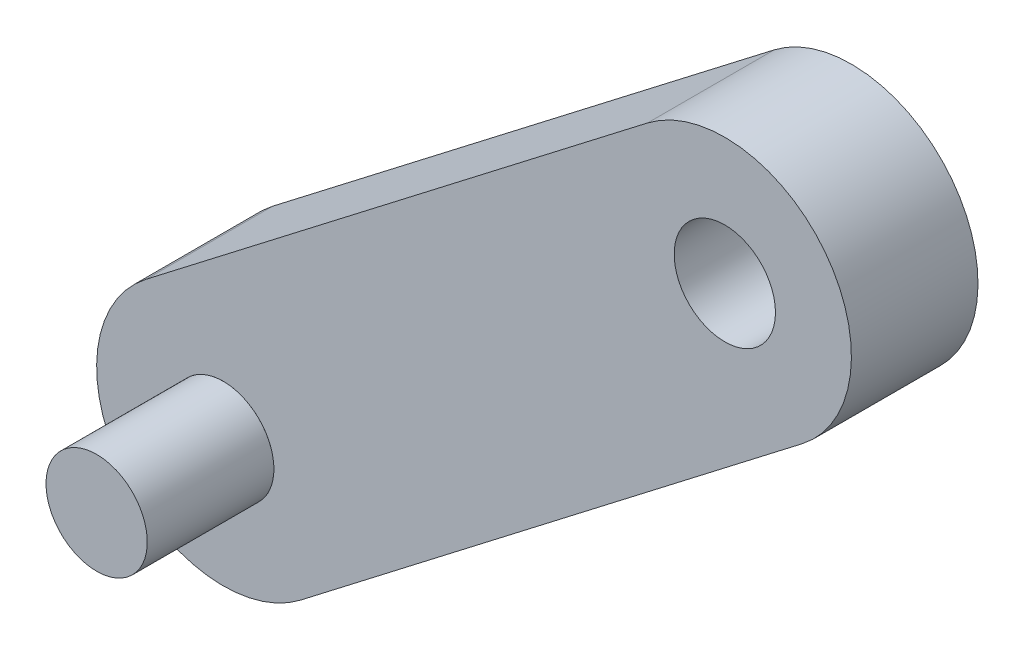
ISO-10303-21;
HEADER;
FILE_DESCRIPTION(('STEP AP214'),'2;1');
FILE_NAME('part.step','',(''),(''),'','','');
FILE_SCHEMA(('AUTOMOTIVE_DESIGN { 1 0 10303 214 1 1 1 1 }'));
ENDSEC;
DATA;
#1=APPLICATION_CONTEXT('core data for automotive mechanical design processes');
#2=APPLICATION_PROTOCOL_DEFINITION('international standard','automotive_design',2000,#1);
#3=PRODUCT_CONTEXT('',#1,'mechanical');
#4=PRODUCT('Part','Part','',(#3));
#5=PRODUCT_RELATED_PRODUCT_CATEGORY('part','',(#4));
#6=PRODUCT_DEFINITION_FORMATION('','',#4);
#7=PRODUCT_DEFINITION_CONTEXT('part definition',#1,'design');
#8=PRODUCT_DEFINITION('design','',#6,#7);
#9=PRODUCT_DEFINITION_SHAPE('','',#8);
#10=(LENGTH_UNIT() NAMED_UNIT(*) SI_UNIT(.MILLI.,.METRE.));
#11=(NAMED_UNIT(*) PLANE_ANGLE_UNIT() SI_UNIT($,.RADIAN.));
#12=(NAMED_UNIT(*) SI_UNIT($,.STERADIAN.) SOLID_ANGLE_UNIT());
#13=UNCERTAINTY_MEASURE_WITH_UNIT(LENGTH_MEASURE(1.E-05),#10,'distance_accuracy_value','');
#14=(GEOMETRIC_REPRESENTATION_CONTEXT(3) GLOBAL_UNCERTAINTY_ASSIGNED_CONTEXT((#13)) GLOBAL_UNIT_ASSIGNED_CONTEXT((#10,
#11,#12)) REPRESENTATION_CONTEXT('',''));
#15=CARTESIAN_POINT('',(0.,0.,0.));
#16=DIRECTION('',(0.,0.,1.));
#17=DIRECTION('',(1.,0.,0.));
#18=AXIS2_PLACEMENT_3D('',#15,#16,#17);
#19=CARTESIAN_POINT('',(-44.3801418640162,84.6953489238267,5.));
#20=DIRECTION('',(0.,0.,-1.));
#21=DIRECTION('',(1.,0.,0.));
#22=AXIS2_PLACEMENT_3D('',#19,#20,#21);
#23=CYLINDRICAL_SURFACE('',#22,2.);
#24=CARTESIAN_POINT('',(-44.3801418640162,84.6953489238267,5.));
#25=DIRECTION('',(0.,0.,-1.));
#26=DIRECTION('',(-1.,0.,0.));
#27=AXIS2_PLACEMENT_3D('',#24,#25,#26);
#28=CIRCLE('',#27,2.);
#29=CARTESIAN_POINT('',(-46.3801418640162,84.6953489238267,5.));
#30=VERTEX_POINT('',#29);
#31=EDGE_CURVE('E11',#30,#30,#28,.T.);
#32=ORIENTED_EDGE('',*,*,#31,.T.);
#33=EDGE_LOOP('',(#32));
#34=FACE_BOUND('',#33,.T.);
#35=CARTESIAN_POINT('',(-44.3801418640162,84.6953489238267,0.));
#36=DIRECTION('',(0.,0.,-1.));
#37=DIRECTION('',(-1.,0.,0.));
#38=AXIS2_PLACEMENT_3D('',#35,#36,#37);
#39=CIRCLE('',#38,2.);
#40=CARTESIAN_POINT('',(-46.3801418640162,84.6953489238267,0.));
#41=VERTEX_POINT('',#40);
#42=EDGE_CURVE('E48',#41,#41,#39,.T.);
#43=ORIENTED_EDGE('',*,*,#42,.F.);
#44=EDGE_LOOP('',(#43));
#45=FACE_BOUND('',#44,.T.);
#46=ADVANCED_FACE('F45',(#34,#45),#23,.T.);
#47=CARTESIAN_POINT('',(-44.3801418640162,84.6953489238267,5.));
#48=DIRECTION('',(0.,0.,1.));
#49=DIRECTION('',(-1.,0.,0.));
#50=AXIS2_PLACEMENT_3D('',#47,#48,#49);
#51=PLANE('',#50);
#52=ORIENTED_EDGE('',*,*,#31,.F.);
#53=EDGE_LOOP('',(#52));
#54=FACE_BOUND('',#53,.T.);
#55=ADVANCED_FACE('F60',(#54),#51,.T.);
#56=CARTESIAN_POINT('',(-44.3801418640162,84.6953489238267,0.));
#57=DIRECTION('',(0.,0.,1.));
#58=DIRECTION('',(-1.,0.,0.));
#59=AXIS2_PLACEMENT_3D('',#56,#57,#58);
#60=PLANE('',#59);
#61=ORIENTED_EDGE('',*,*,#42,.T.);
#62=EDGE_LOOP('',(#61));
#63=FACE_BOUND('',#62,.T.);
#64=ADVANCED_FACE('F57',(#63),#60,.F.);
#65=CLOSED_SHELL('',(#46,#55,#64));
#66=MANIFOLD_SOLID_BREP('B2',#65);
#67=CARTESIAN_POINT('',(-54.4085511361733,70.6633839518424,-5.));
#68=DIRECTION('',(-0.610077729525656,0.792341570244058,0.));
#69=DIRECTION('',(-0.792341570244058,-0.610077729525656,0.));
#70=AXIS2_PLACEMENT_3D('',#67,#68,#69);
#71=PLANE('',#70);
#72=DIRECTION('',(0.792341570244058,0.610077729525656,0.));
#73=VECTOR('',#72,1.);
#74=CARTESIAN_POINT('',(-54.4085511361733,70.6633839518424,0.));
#75=LINE('',#74,#73);
#76=CARTESIAN_POINT('',(-41.3297532163879,80.7336410726064,0.));
#77=VERTEX_POINT('',#76);
#78=CARTESIAN_POINT('',(-21.5212139602865,95.9855843107478,0.));
#79=VERTEX_POINT('',#78);
#80=EDGE_CURVE('E158',#77,#79,#75,.T.);
#81=ORIENTED_EDGE('',*,*,#80,.F.);
#82=DIRECTION('',(0.,0.,1.));
#83=VECTOR('',#82,1.);
#84=CARTESIAN_POINT('',(-41.3297532163879,80.7336410726064,-5.));
#85=LINE('',#84,#83);
#86=CARTESIAN_POINT('',(-41.3297532163879,80.7336410726064,-5.));
#87=VERTEX_POINT('',#86);
#88=EDGE_CURVE('E151',#87,#77,#85,.T.);
#89=ORIENTED_EDGE('',*,*,#88,.F.);
#90=DIRECTION('',(0.792341570244058,0.610077729525656,0.));
#91=VECTOR('',#90,1.);
#92=CARTESIAN_POINT('',(-54.4085511361733,70.6633839518424,-5.));
#93=LINE('',#92,#91);
#94=CARTESIAN_POINT('',(-21.5212139602865,95.9855843107478,-5.));
#95=VERTEX_POINT('',#94);
#96=EDGE_CURVE('E144',#87,#95,#93,.T.);
#97=ORIENTED_EDGE('',*,*,#96,.T.);
#98=DIRECTION('',(0.,0.,1.));
#99=VECTOR('',#98,1.);
#100=CARTESIAN_POINT('',(-21.5212139602865,95.9855843107478,-5.));
#101=LINE('',#100,#99);
#102=EDGE_CURVE('E43',#95,#79,#101,.T.);
#103=ORIENTED_EDGE('',*,*,#102,.T.);
#104=EDGE_LOOP('',(#81,#89,#97,#103));
#105=FACE_BOUND('',#104,.T.);
#106=ADVANCED_FACE('F86',(#105),#71,.F.);
#107=CARTESIAN_POINT('',(-24.5716026079148,99.9472921619681,-5.));
#108=DIRECTION('',(0.,0.,1.));
#109=DIRECTION('',(-1.,0.,0.));
#110=AXIS2_PLACEMENT_3D('',#107,#108,#109);
#111=CYLINDRICAL_SURFACE('',#110,5.00000000000002);
#112=CARTESIAN_POINT('',(-24.5716026079148,99.9472921619681,0.));
#113=DIRECTION('',(0.,0.,1.));
#114=DIRECTION('',(1.,0.,0.));
#115=AXIS2_PLACEMENT_3D('',#112,#113,#114);
#116=CIRCLE('',#115,5.00000000000002);
#117=CARTESIAN_POINT('',(-27.6219912555431,103.909000013188,0.));
#118=VERTEX_POINT('',#117);
#119=EDGE_CURVE('E160',#79,#118,#116,.T.);
#120=ORIENTED_EDGE('',*,*,#119,.F.);
#121=ORIENTED_EDGE('',*,*,#102,.F.);
#122=CARTESIAN_POINT('',(-24.5716026079148,99.9472921619681,-5.));
#123=DIRECTION('',(0.,0.,1.));
#124=DIRECTION('',(1.,0.,0.));
#125=AXIS2_PLACEMENT_3D('',#122,#123,#124);
#126=CIRCLE('',#125,5.00000000000002);
#127=CARTESIAN_POINT('',(-27.6219912555431,103.909000013188,-5.));
#128=VERTEX_POINT('',#127);
#129=EDGE_CURVE('E128',#95,#128,#126,.T.);
#130=ORIENTED_EDGE('',*,*,#129,.T.);
#131=DIRECTION('',(0.,0.,1.));
#132=VECTOR('',#131,1.);
#133=CARTESIAN_POINT('',(-27.6219912555431,103.909000013188,-5.));
#134=LINE('',#133,#132);
#135=EDGE_CURVE('E95',#128,#118,#134,.T.);
#136=ORIENTED_EDGE('',*,*,#135,.T.);
#137=EDGE_LOOP('',(#120,#121,#130,#136));
#138=FACE_BOUND('',#137,.T.);
#139=ADVANCED_FACE('F142',(#138),#111,.T.);
#140=CARTESIAN_POINT('',(-60.50932843143,78.5867996542829,-5.));
#141=DIRECTION('',(-0.610077729525657,0.792341570244058,0.));
#142=DIRECTION('',(-0.792341570244058,-0.610077729525657,0.));
#143=AXIS2_PLACEMENT_3D('',#140,#141,#142);
#144=PLANE('',#143);
#145=DIRECTION('',(0.792341570244058,0.610077729525657,0.));
#146=VECTOR('',#145,1.);
#147=CARTESIAN_POINT('',(-60.50932843143,78.5867996542829,0.));
#148=LINE('',#147,#146);
#149=CARTESIAN_POINT('',(-47.4305305116445,88.657056775047,0.));
#150=VERTEX_POINT('',#149);
#151=EDGE_CURVE('E138',#150,#118,#148,.T.);
#152=ORIENTED_EDGE('',*,*,#151,.T.);
#153=ORIENTED_EDGE('',*,*,#135,.F.);
#154=DIRECTION('',(0.792341570244058,0.610077729525657,0.));
#155=VECTOR('',#154,1.);
#156=CARTESIAN_POINT('',(-60.50932843143,78.5867996542829,-5.));
#157=LINE('',#156,#155);
#158=CARTESIAN_POINT('',(-47.4305305116445,88.657056775047,-5.));
#159=VERTEX_POINT('',#158);
#160=EDGE_CURVE('E131',#159,#128,#157,.T.);
#161=ORIENTED_EDGE('',*,*,#160,.F.);
#162=DIRECTION('',(0.,0.,1.));
#163=VECTOR('',#162,1.);
#164=CARTESIAN_POINT('',(-47.4305305116445,88.657056775047,-5.));
#165=LINE('',#164,#163);
#166=EDGE_CURVE('E141',#159,#150,#165,.T.);
#167=ORIENTED_EDGE('',*,*,#166,.T.);
#168=EDGE_LOOP('',(#152,#153,#161,#167));
#169=FACE_BOUND('',#168,.T.);
#170=ADVANCED_FACE('F137',(#169),#144,.T.);
#171=CARTESIAN_POINT('',(-44.3801418640162,84.6953489238267,-5.));
#172=DIRECTION('',(0.,0.,1.));
#173=DIRECTION('',(-1.,0.,0.));
#174=AXIS2_PLACEMENT_3D('',#171,#172,#173);
#175=CYLINDRICAL_SURFACE('',#174,2.);
#176=CARTESIAN_POINT('',(-44.3801418640162,84.6953489238267,-5.));
#177=DIRECTION('',(0.,0.,1.));
#178=DIRECTION('',(1.,0.,0.));
#179=AXIS2_PLACEMENT_3D('',#176,#177,#178);
#180=CIRCLE('',#179,2.);
#181=CARTESIAN_POINT('',(-42.3801418640162,84.6953489238267,-5.));
#182=VERTEX_POINT('',#181);
#183=EDGE_CURVE('E146',#182,#182,#180,.T.);
#184=ORIENTED_EDGE('',*,*,#183,.F.);
#185=EDGE_LOOP('',(#184));
#186=FACE_BOUND('',#185,.T.);
#187=CARTESIAN_POINT('',(-44.3801418640162,84.6953489238267,0.));
#188=DIRECTION('',(0.,0.,1.));
#189=DIRECTION('',(1.,0.,0.));
#190=AXIS2_PLACEMENT_3D('',#187,#188,#189);
#191=CIRCLE('',#190,2.);
#192=CARTESIAN_POINT('',(-42.3801418640162,84.6953489238267,0.));
#193=VERTEX_POINT('',#192);
#194=EDGE_CURVE('E155',#193,#193,#191,.T.);
#195=ORIENTED_EDGE('',*,*,#194,.T.);
#196=EDGE_LOOP('',(#195));
#197=FACE_BOUND('',#196,.T.);
#198=ADVANCED_FACE('F179',(#186,#197),#175,.F.);
#199=CARTESIAN_POINT('',(-24.5716026079148,99.9472921619681,-5.));
#200=DIRECTION('',(0.,0.,1.));
#201=DIRECTION('',(-1.,0.,0.));
#202=AXIS2_PLACEMENT_3D('',#199,#200,#201);
#203=CYLINDRICAL_SURFACE('',#202,2.00000000000001);
#204=CARTESIAN_POINT('',(-24.5716026079148,99.9472921619681,-5.));
#205=DIRECTION('',(0.,0.,1.));
#206=DIRECTION('',(1.,0.,0.));
#207=AXIS2_PLACEMENT_3D('',#204,#205,#206);
#208=CIRCLE('',#207,2.00000000000001);
#209=CARTESIAN_POINT('',(-22.5716026079148,99.9472921619681,-5.));
#210=VERTEX_POINT('',#209);
#211=EDGE_CURVE('E164',#210,#210,#208,.T.);
#212=ORIENTED_EDGE('',*,*,#211,.F.);
#213=EDGE_LOOP('',(#212));
#214=FACE_BOUND('',#213,.T.);
#215=CARTESIAN_POINT('',(-24.5716026079148,99.9472921619681,0.));
#216=DIRECTION('',(0.,0.,1.));
#217=DIRECTION('',(1.,0.,0.));
#218=AXIS2_PLACEMENT_3D('',#215,#216,#217);
#219=CIRCLE('',#218,2.00000000000001);
#220=CARTESIAN_POINT('',(-22.5716026079148,99.9472921619681,0.));
#221=VERTEX_POINT('',#220);
#222=EDGE_CURVE('E152',#221,#221,#219,.T.);
#223=ORIENTED_EDGE('',*,*,#222,.T.);
#224=EDGE_LOOP('',(#223));
#225=FACE_BOUND('',#224,.T.);
#226=ADVANCED_FACE('F88',(#214,#225),#203,.F.);
#227=CARTESIAN_POINT('',(-44.3801418640162,84.6953489238267,-5.));
#228=DIRECTION('',(0.,0.,1.));
#229=DIRECTION('',(-1.,0.,0.));
#230=AXIS2_PLACEMENT_3D('',#227,#228,#229);
#231=CYLINDRICAL_SURFACE('',#230,5.);
#232=CARTESIAN_POINT('',(-44.3801418640162,84.6953489238267,0.));
#233=DIRECTION('',(0.,0.,1.));
#234=DIRECTION('',(1.,0.,0.));
#235=AXIS2_PLACEMENT_3D('',#232,#233,#234);
#236=CIRCLE('',#235,5.);
#237=EDGE_CURVE('E117',#150,#77,#236,.T.);
#238=ORIENTED_EDGE('',*,*,#237,.F.);
#239=ORIENTED_EDGE('',*,*,#166,.F.);
#240=CARTESIAN_POINT('',(-44.3801418640162,84.6953489238267,-5.));
#241=DIRECTION('',(0.,0.,1.));
#242=DIRECTION('',(1.,0.,0.));
#243=AXIS2_PLACEMENT_3D('',#240,#241,#242);
#244=CIRCLE('',#243,5.);
#245=EDGE_CURVE('E103',#159,#87,#244,.T.);
#246=ORIENTED_EDGE('',*,*,#245,.T.);
#247=ORIENTED_EDGE('',*,*,#88,.T.);
#248=EDGE_LOOP('',(#238,#239,#246,#247));
#249=FACE_BOUND('',#248,.T.);
#250=ADVANCED_FACE('F170',(#249),#231,.T.);
#251=CARTESIAN_POINT('',(0.,0.,-5.));
#252=DIRECTION('',(0.,0.,-1.));
#253=DIRECTION('',(1.,0.,0.));
#254=AXIS2_PLACEMENT_3D('',#251,#252,#253);
#255=PLANE('',#254);
#256=ORIENTED_EDGE('',*,*,#211,.T.);
#257=EDGE_LOOP('',(#256));
#258=FACE_BOUND('',#257,.T.);
#259=ORIENTED_EDGE('',*,*,#183,.T.);
#260=EDGE_LOOP('',(#259));
#261=FACE_BOUND('',#260,.T.);
#262=ORIENTED_EDGE('',*,*,#96,.F.);
#263=ORIENTED_EDGE('',*,*,#245,.F.);
#264=ORIENTED_EDGE('',*,*,#160,.T.);
#265=ORIENTED_EDGE('',*,*,#129,.F.);
#266=EDGE_LOOP('',(#262,#263,#264,#265));
#267=FACE_BOUND('',#266,.T.);
#268=ADVANCED_FACE('F133',(#258,#261,#267),#255,.T.);
#269=CARTESIAN_POINT('',(0.,0.,0.));
#270=DIRECTION('',(0.,0.,-1.));
#271=DIRECTION('',(1.,0.,0.));
#272=AXIS2_PLACEMENT_3D('',#269,#270,#271);
#273=PLANE('',#272);
#274=ORIENTED_EDGE('',*,*,#222,.F.);
#275=EDGE_LOOP('',(#274));
#276=FACE_BOUND('',#275,.T.);
#277=ORIENTED_EDGE('',*,*,#194,.F.);
#278=EDGE_LOOP('',(#277));
#279=FACE_BOUND('',#278,.T.);
#280=ORIENTED_EDGE('',*,*,#80,.T.);
#281=ORIENTED_EDGE('',*,*,#119,.T.);
#282=ORIENTED_EDGE('',*,*,#151,.F.);
#283=ORIENTED_EDGE('',*,*,#237,.T.);
#284=EDGE_LOOP('',(#280,#281,#282,#283));
#285=FACE_BOUND('',#284,.T.);
#286=ADVANCED_FACE('F166',(#276,#279,#285),#273,.F.);
#287=CLOSED_SHELL('',(#106,#139,#170,#198,#226,#250,#268,#286));
#288=MANIFOLD_SOLID_BREP('B6',#287);
#289=ADVANCED_BREP_SHAPE_REPRESENTATION('',(#18,#66,#288),#14);
#290=SHAPE_DEFINITION_REPRESENTATION(#9,#289);
ENDSEC;
END-ISO-10303-21;
